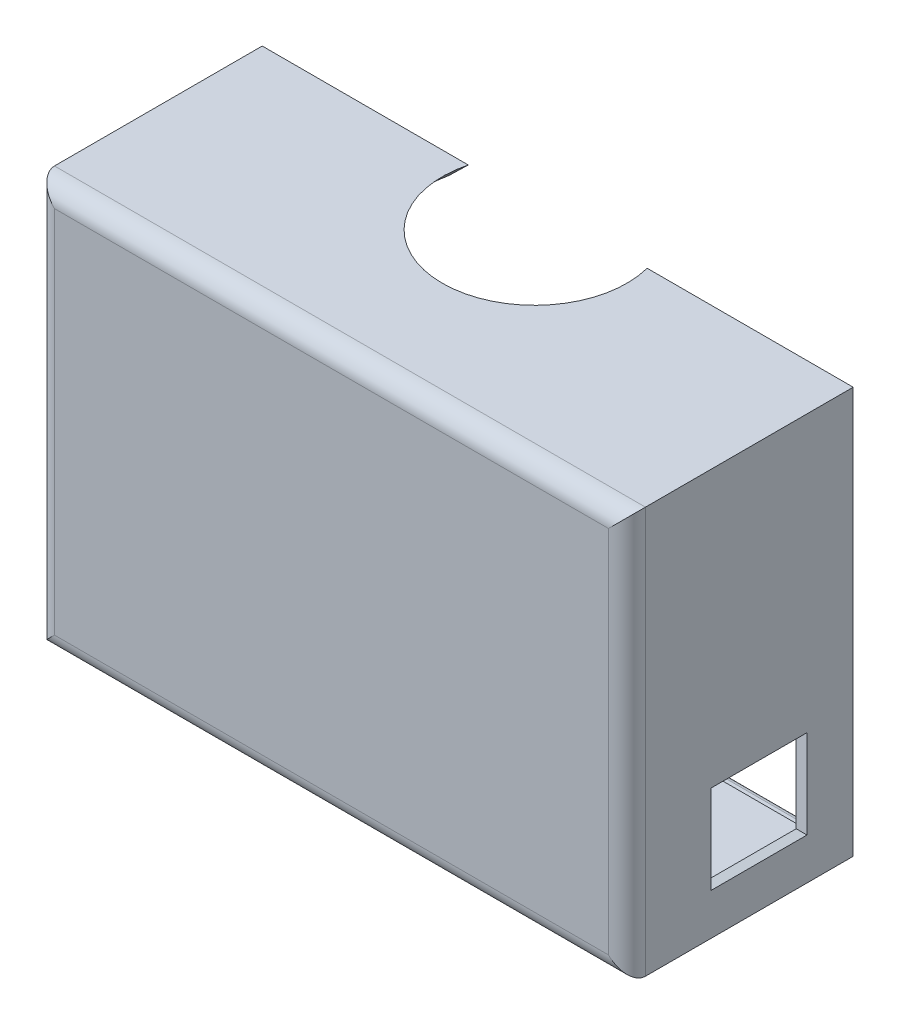
ISO-10303-21;
HEADER;
FILE_DESCRIPTION(('STEP AP214'),'2;1');
FILE_NAME('part.step','',(''),(''),'','','');
FILE_SCHEMA(('AUTOMOTIVE_DESIGN { 1 0 10303 214 1 1 1 1 }'));
ENDSEC;
DATA;
#1=APPLICATION_CONTEXT('core data for automotive mechanical design processes');
#2=APPLICATION_PROTOCOL_DEFINITION('international standard','automotive_design',2000,#1);
#3=PRODUCT_CONTEXT('',#1,'mechanical');
#4=PRODUCT('Part','Part','',(#3));
#5=PRODUCT_RELATED_PRODUCT_CATEGORY('part','',(#4));
#6=PRODUCT_DEFINITION_FORMATION('','',#4);
#7=PRODUCT_DEFINITION_CONTEXT('part definition',#1,'design');
#8=PRODUCT_DEFINITION('design','',#6,#7);
#9=PRODUCT_DEFINITION_SHAPE('','',#8);
#10=(LENGTH_UNIT() NAMED_UNIT(*) SI_UNIT(.MILLI.,.METRE.));
#11=(NAMED_UNIT(*) PLANE_ANGLE_UNIT() SI_UNIT($,.RADIAN.));
#12=(NAMED_UNIT(*) SI_UNIT($,.STERADIAN.) SOLID_ANGLE_UNIT());
#13=UNCERTAINTY_MEASURE_WITH_UNIT(LENGTH_MEASURE(1.E-05),#10,'distance_accuracy_value','');
#14=(GEOMETRIC_REPRESENTATION_CONTEXT(3) GLOBAL_UNCERTAINTY_ASSIGNED_CONTEXT((#13)) GLOBAL_UNIT_ASSIGNED_CONTEXT((#10,
#11,#12)) REPRESENTATION_CONTEXT('',''));
#15=CARTESIAN_POINT('',(0.,0.,0.));
#16=DIRECTION('',(0.,0.,1.));
#17=DIRECTION('',(1.,0.,0.));
#18=AXIS2_PLACEMENT_3D('',#15,#16,#17);
#19=CARTESIAN_POINT('',(-35.1511127596439,30.4555044510386,28.575));
#20=DIRECTION('',(1.,0.,0.));
#21=DIRECTION('',(0.,1.,0.));
#22=AXIS2_PLACEMENT_3D('',#19,#20,#21);
#23=PLANE('',#22);
#24=DIRECTION('',(0.,0.,-1.));
#25=VECTOR('',#24,1.);
#26=CARTESIAN_POINT('',(-35.1511127596439,-20.3444955489614,28.575));
#27=LINE('',#26,#25);
#28=CARTESIAN_POINT('',(-35.1511127596439,-20.3444955489614,28.575));
#29=VERTEX_POINT('',#28);
#30=CARTESIAN_POINT('',(-35.1511127596439,-20.3444955489614,2.54));
#31=VERTEX_POINT('',#30);
#32=EDGE_CURVE('E284',#29,#31,#27,.T.);
#33=ORIENTED_EDGE('',*,*,#32,.T.);
#34=DIRECTION('',(0.,-1.,0.));
#35=VECTOR('',#34,1.);
#36=CARTESIAN_POINT('',(-35.1511127596439,30.4555044510386,2.54));
#37=LINE('',#36,#35);
#38=CARTESIAN_POINT('',(-35.1511127596439,30.4555044510386,2.54));
#39=VERTEX_POINT('',#38);
#40=EDGE_CURVE('E242',#39,#31,#37,.T.);
#41=ORIENTED_EDGE('',*,*,#40,.F.);
#42=DIRECTION('',(0.,0.,-1.));
#43=VECTOR('',#42,1.);
#44=CARTESIAN_POINT('',(-35.1511127596439,30.4555044510386,28.575));
#45=LINE('',#44,#43);
#46=CARTESIAN_POINT('',(-35.1511127596439,30.4555044510386,28.575));
#47=VERTEX_POINT('',#46);
#48=EDGE_CURVE('E275',#47,#39,#45,.T.);
#49=ORIENTED_EDGE('',*,*,#48,.F.);
#50=DIRECTION('',(0.,-1.,0.));
#51=VECTOR('',#50,1.);
#52=CARTESIAN_POINT('',(-35.1511127596439,30.4555044510386,28.575));
#53=LINE('',#52,#51);
#54=EDGE_CURVE('E263',#47,#29,#53,.T.);
#55=ORIENTED_EDGE('',*,*,#54,.T.);
#56=EDGE_LOOP('',(#33,#41,#49,#55));
#57=FACE_BOUND('',#56,.T.);
#58=ADVANCED_FACE('F33',(#57),#23,.T.);
#59=CARTESIAN_POINT('',(-35.1511127596439,-20.3444955489614,28.575));
#60=DIRECTION('',(0.,1.,0.));
#61=DIRECTION('',(0.,0.,1.));
#62=AXIS2_PLACEMENT_3D('',#59,#60,#61);
#63=PLANE('',#62);
#64=DIRECTION('',(0.,0.,-1.));
#65=VECTOR('',#64,1.);
#66=CARTESIAN_POINT('',(41.0488872403561,-20.3444955489614,28.575));
#67=LINE('',#66,#65);
#68=CARTESIAN_POINT('',(41.0488872403561,-20.3444955489614,28.575));
#69=VERTEX_POINT('',#68);
#70=CARTESIAN_POINT('',(41.0488872403561,-20.3444955489614,2.54));
#71=VERTEX_POINT('',#70);
#72=EDGE_CURVE('E281',#69,#71,#67,.T.);
#73=ORIENTED_EDGE('',*,*,#72,.T.);
#74=DIRECTION('',(1.,0.,0.));
#75=VECTOR('',#74,1.);
#76=CARTESIAN_POINT('',(41.0488872403561,-20.3444955489614,2.54));
#77=LINE('',#76,#75);
#78=EDGE_CURVE('E238',#31,#71,#77,.T.);
#79=ORIENTED_EDGE('',*,*,#78,.F.);
#80=ORIENTED_EDGE('',*,*,#32,.F.);
#81=DIRECTION('',(1.,0.,0.));
#82=VECTOR('',#81,1.);
#83=CARTESIAN_POINT('',(-35.1511127596439,-20.3444955489614,28.575));
#84=LINE('',#83,#82);
#85=EDGE_CURVE('E266',#29,#69,#84,.T.);
#86=ORIENTED_EDGE('',*,*,#85,.T.);
#87=EDGE_LOOP('',(#73,#79,#80,#86));
#88=FACE_BOUND('',#87,.T.);
#89=ADVANCED_FACE('F392',(#88),#63,.T.);
#90=CARTESIAN_POINT('',(41.0488872403561,30.4555044510386,28.575));
#91=DIRECTION('',(-1.,0.,0.));
#92=DIRECTION('',(0.,0.,1.));
#93=AXIS2_PLACEMENT_3D('',#90,#91,#92);
#94=PLANE('',#93);
#95=DIRECTION('',(0.,-1.,0.));
#96=VECTOR('',#95,1.);
#97=CARTESIAN_POINT('',(41.0488872403561,-17.1694955489614,20.6101024484277));
#98=LINE('',#97,#96);
#99=CARTESIAN_POINT('',(41.0488872403561,-3.92539310053377,20.6101024484277));
#100=VERTEX_POINT('',#99);
#101=CARTESIAN_POINT('',(41.0488872403561,-18.2215979973891,20.6101024484277));
#102=VERTEX_POINT('',#101);
#103=EDGE_CURVE('E312',#100,#102,#98,.T.);
#104=ORIENTED_EDGE('',*,*,#103,.T.);
#105=DIRECTION('',(0.,0.,-1.));
#106=VECTOR('',#105,1.);
#107=CARTESIAN_POINT('',(41.0488872403561,-18.2215979973891,6.35));
#108=LINE('',#107,#106);
#109=CARTESIAN_POINT('',(41.0488872403561,-18.2215979973891,5.29789755157234));
#110=VERTEX_POINT('',#109);
#111=EDGE_CURVE('E314',#102,#110,#108,.T.);
#112=ORIENTED_EDGE('',*,*,#111,.T.);
#113=DIRECTION('',(0.,1.,0.));
#114=VECTOR('',#113,1.);
#115=CARTESIAN_POINT('',(41.0488872403561,-4.97749554896143,5.29789755157234));
#116=LINE('',#115,#114);
#117=CARTESIAN_POINT('',(41.0488872403561,-3.92539310053377,5.29789755157234));
#118=VERTEX_POINT('',#117);
#119=EDGE_CURVE('E308',#110,#118,#116,.T.);
#120=ORIENTED_EDGE('',*,*,#119,.T.);
#121=DIRECTION('',(0.,0.,1.));
#122=VECTOR('',#121,1.);
#123=CARTESIAN_POINT('',(41.0488872403561,-3.92539310053377,19.558));
#124=LINE('',#123,#122);
#125=EDGE_CURVE('E310',#118,#100,#124,.T.);
#126=ORIENTED_EDGE('',*,*,#125,.T.);
#127=EDGE_LOOP('',(#104,#112,#120,#126));
#128=FACE_BOUND('',#127,.T.);
#129=DIRECTION('',(0.,0.,-1.));
#130=VECTOR('',#129,1.);
#131=CARTESIAN_POINT('',(41.0488872403561,30.4555044510386,28.575));
#132=LINE('',#131,#130);
#133=CARTESIAN_POINT('',(41.0488872403561,30.4555044510386,28.575));
#134=VERTEX_POINT('',#133);
#135=CARTESIAN_POINT('',(41.0488872403561,30.4555044510386,2.54));
#136=VERTEX_POINT('',#135);
#137=EDGE_CURVE('E279',#134,#136,#132,.T.);
#138=ORIENTED_EDGE('',*,*,#137,.T.);
#139=DIRECTION('',(0.,1.,0.));
#140=VECTOR('',#139,1.);
#141=CARTESIAN_POINT('',(41.0488872403561,30.4555044510386,2.54));
#142=LINE('',#141,#140);
#143=EDGE_CURVE('E228',#71,#136,#142,.T.);
#144=ORIENTED_EDGE('',*,*,#143,.F.);
#145=ORIENTED_EDGE('',*,*,#72,.F.);
#146=DIRECTION('',(0.,1.,0.));
#147=VECTOR('',#146,1.);
#148=CARTESIAN_POINT('',(41.0488872403561,30.4555044510386,28.575));
#149=LINE('',#148,#147);
#150=EDGE_CURVE('E269',#69,#134,#149,.T.);
#151=ORIENTED_EDGE('',*,*,#150,.T.);
#152=EDGE_LOOP('',(#138,#144,#145,#151));
#153=FACE_BOUND('',#152,.T.);
#154=ADVANCED_FACE('F349',(#128,#153),#94,.T.);
#155=CARTESIAN_POINT('',(0.,0.,0.));
#156=DIRECTION('',(0.,0.,1.));
#157=DIRECTION('',(1.,0.,0.));
#158=AXIS2_PLACEMENT_3D('',#155,#156,#157);
#159=PLANE('',#158);
#160=DIRECTION('',(1.,0.,0.));
#161=VECTOR('',#160,1.);
#162=CARTESIAN_POINT('',(0.,32.4875044510386,0.));
#163=LINE('',#162,#161);
#164=CARTESIAN_POINT('',(43.0808872403561,32.4875044510386,0.));
#165=VERTEX_POINT('',#164);
#166=CARTESIAN_POINT('',(21.9988872403561,32.4875044510386,0.));
#167=VERTEX_POINT('',#166);
#168=EDGE_CURVE('E460',#165,#167,#163,.F.);
#169=ORIENTED_EDGE('',*,*,#168,.T.);
#170=DIRECTION('',(0.,1.,0.));
#171=VECTOR('',#170,1.);
#172=CARTESIAN_POINT('',(21.9988872403561,31.7255044510386,0.));
#173=LINE('',#172,#171);
#174=CARTESIAN_POINT('',(21.9988872403561,30.4555044510386,0.));
#175=VERTEX_POINT('',#174);
#176=EDGE_CURVE('E407',#175,#167,#173,.T.);
#177=ORIENTED_EDGE('',*,*,#176,.F.);
#178=DIRECTION('',(-1.,0.,0.));
#179=VECTOR('',#178,1.);
#180=CARTESIAN_POINT('',(-35.1511127596439,30.4555044510386,0.));
#181=LINE('',#180,#179);
#182=CARTESIAN_POINT('',(17.8544893751241,30.4555044510386,0.));
#183=VERTEX_POINT('',#182);
#184=EDGE_CURVE('E237',#175,#183,#181,.T.);
#185=ORIENTED_EDGE('',*,*,#184,.T.);
#186=CARTESIAN_POINT('',(17.8544893751241,30.4555044510386,0.));
#187=CARTESIAN_POINT('',(17.6375656491127,30.6676666900331,0.));
#188=CARTESIAN_POINT('',(17.4205431148589,30.8797279697235,0.));
#189=CARTESIAN_POINT('',(16.9862691020261,31.3036152837259,0.));
#190=CARTESIAN_POINT('',(16.7690176238058,31.5154413184053,0.));
#191=CARTESIAN_POINT('',(16.3342536315907,31.9388255625029,0.));
#192=CARTESIAN_POINT('',(16.1167411174934,32.1503837718159,0.));
#193=CARTESIAN_POINT('',(15.6814129614903,32.5731887455268,0.));
#194=CARTESIAN_POINT('',(15.4635973191101,32.7844355094364,0.));
#195=CARTESIAN_POINT('',(15.2456093645647,32.9955044510386,0.));
#196=B_SPLINE_CURVE_WITH_KNOTS('',3,(#186,#187,#188,#189,#190,#191,#192,#193,#194,#195),
.UNSPECIFIED.,.F.,.F.,(4,2,2,2,4),(0.,0.910284860639138,1.82056829776038,2.73085209228318,
3.64113731247536),.UNSPECIFIED.);
#197=CARTESIAN_POINT('',(15.2456093645646,32.9955044510386,0.));
#198=VERTEX_POINT('',#197);
#199=EDGE_CURVE('E317',#183,#198,#196,.T.);
#200=ORIENTED_EDGE('',*,*,#199,.T.);
#201=DIRECTION('',(-1.,0.,0.));
#202=VECTOR('',#201,1.);
#203=CARTESIAN_POINT('',(-37.6911127596439,32.9955044510386,0.));
#204=LINE('',#203,#202);
#205=CARTESIAN_POINT('',(43.5888872403561,32.9955044510386,0.));
#206=VERTEX_POINT('',#205);
#207=EDGE_CURVE('E297',#206,#198,#204,.T.);
#208=ORIENTED_EDGE('',*,*,#207,.F.);
#209=DIRECTION('',(0.,1.,0.));
#210=VECTOR('',#209,1.);
#211=CARTESIAN_POINT('',(43.5888872403561,32.9955044510386,0.));
#212=LINE('',#211,#210);
#213=CARTESIAN_POINT('',(43.5888872403561,-22.8844955489614,0.));
#214=VERTEX_POINT('',#213);
#215=EDGE_CURVE('E293',#214,#206,#212,.T.);
#216=ORIENTED_EDGE('',*,*,#215,.F.);
#217=DIRECTION('',(1.,0.,0.));
#218=VECTOR('',#217,1.);
#219=CARTESIAN_POINT('',(-37.6911127596439,-22.8844955489614,0.));
#220=LINE('',#219,#218);
#221=CARTESIAN_POINT('',(-37.6911127596439,-22.8844955489614,0.));
#222=VERTEX_POINT('',#221);
#223=EDGE_CURVE('E290',#222,#214,#220,.T.);
#224=ORIENTED_EDGE('',*,*,#223,.F.);
#225=DIRECTION('',(0.,-1.,0.));
#226=VECTOR('',#225,1.);
#227=CARTESIAN_POINT('',(-37.6911127596439,32.9955044510386,0.));
#228=LINE('',#227,#226);
#229=CARTESIAN_POINT('',(-37.6911127596439,32.9955044510386,0.));
#230=VERTEX_POINT('',#229);
#231=EDGE_CURVE('E287',#230,#222,#228,.T.);
#232=ORIENTED_EDGE('',*,*,#231,.F.);
#233=CARTESIAN_POINT('',(-9.34783488385245,32.9955044510386,0.));
#234=VERTEX_POINT('',#233);
#235=EDGE_CURVE('E296',#234,#230,#204,.T.);
#236=ORIENTED_EDGE('',*,*,#235,.F.);
#237=CARTESIAN_POINT('',(-9.34783488385245,32.9955044510386,0.));
#238=CARTESIAN_POINT('',(-9.56582283839795,32.7844355094364,0.));
#239=CARTESIAN_POINT('',(-9.78363848077808,32.5731887455268,0.));
#240=CARTESIAN_POINT('',(-10.2189666367812,32.1503837718159,0.));
#241=CARTESIAN_POINT('',(-10.4364791508785,31.9388255625029,0.));
#242=CARTESIAN_POINT('',(-10.8712431430936,31.5154413184053,0.));
#243=CARTESIAN_POINT('',(-11.0884946213139,31.3036152837259,0.));
#244=CARTESIAN_POINT('',(-11.5227686341467,30.8797279697235,0.));
#245=CARTESIAN_POINT('',(-11.7397911684005,30.6676666900331,0.));
#246=CARTESIAN_POINT('',(-11.9567148944119,30.4555044510386,0.));
#247=B_SPLINE_CURVE_WITH_KNOTS('',3,(#237,#238,#239,#240,#241,#242,#243,#244,#245,#246),
.UNSPECIFIED.,.F.,.F.,(4,2,2,2,4),(0.,0.910285220192179,1.82056901471498,2.73085245183623,
3.64113731247536),.UNSPECIFIED.);
#248=CARTESIAN_POINT('',(-11.9567148944119,30.4555044510386,0.));
#249=VERTEX_POINT('',#248);
#250=EDGE_CURVE('E334',#234,#249,#247,.T.);
#251=ORIENTED_EDGE('',*,*,#250,.T.);
#252=CARTESIAN_POINT('',(-16.1011127596439,30.4555044510386,0.));
#253=VERTEX_POINT('',#252);
#254=EDGE_CURVE('E262',#249,#253,#181,.T.);
#255=ORIENTED_EDGE('',*,*,#254,.T.);
#256=DIRECTION('',(0.,-1.,0.));
#257=VECTOR('',#256,1.);
#258=CARTESIAN_POINT('',(-16.1011127596439,31.7255044510386,0.));
#259=LINE('',#258,#257);
#260=CARTESIAN_POINT('',(-16.1011127596439,32.4875044510386,0.));
#261=VERTEX_POINT('',#260);
#262=EDGE_CURVE('E404',#261,#253,#259,.T.);
#263=ORIENTED_EDGE('',*,*,#262,.F.);
#264=DIRECTION('',(1.,0.,0.));
#265=VECTOR('',#264,1.);
#266=CARTESIAN_POINT('',(0.,32.4875044510386,0.));
#267=LINE('',#266,#265);
#268=CARTESIAN_POINT('',(-37.1831127596439,32.4875044510386,0.));
#269=VERTEX_POINT('',#268);
#270=EDGE_CURVE('E564',#261,#269,#267,.F.);
#271=ORIENTED_EDGE('',*,*,#270,.T.);
#272=DIRECTION('',(0.,1.,0.));
#273=VECTOR('',#272,1.);
#274=CARTESIAN_POINT('',(-37.1831127596439,0.,0.));
#275=LINE('',#274,#273);
#276=CARTESIAN_POINT('',(-37.1831127596439,-22.3764955489614,0.));
#277=VERTEX_POINT('',#276);
#278=EDGE_CURVE('E583',#269,#277,#275,.F.);
#279=ORIENTED_EDGE('',*,*,#278,.T.);
#280=DIRECTION('',(-1.,0.,0.));
#281=VECTOR('',#280,1.);
#282=CARTESIAN_POINT('',(0.,-22.3764955489614,0.));
#283=LINE('',#282,#281);
#284=CARTESIAN_POINT('',(43.0808872403561,-22.3764955489614,0.));
#285=VERTEX_POINT('',#284);
#286=EDGE_CURVE('E587',#277,#285,#283,.F.);
#287=ORIENTED_EDGE('',*,*,#286,.T.);
#288=DIRECTION('',(0.,-1.,0.));
#289=VECTOR('',#288,1.);
#290=CARTESIAN_POINT('',(43.0808872403561,0.,0.));
#291=LINE('',#290,#289);
#292=EDGE_CURVE('E589',#285,#165,#291,.F.);
#293=ORIENTED_EDGE('',*,*,#292,.T.);
#294=EDGE_LOOP('',(#169,#177,#185,#200,#208,#216,#224,#232,#236,#251,#255,#263,#271,#279,#287,#293));
#295=FACE_BOUND('',#294,.T.);
#296=ADVANCED_FACE('F343',(#295),#159,.F.);
#297=CARTESIAN_POINT('',(-37.6911127596439,32.9955044510386,28.575));
#298=DIRECTION('',(1.,0.,0.));
#299=DIRECTION('',(0.,0.,-1.));
#300=AXIS2_PLACEMENT_3D('',#297,#298,#299);
#301=PLANE('',#300);
#302=DIRECTION('',(0.,0.,-1.));
#303=VECTOR('',#302,1.);
#304=CARTESIAN_POINT('',(-37.6911127596439,-22.8844955489614,28.575));
#305=LINE('',#304,#303);
#306=CARTESIAN_POINT('',(-37.6911127596439,-22.8844955489614,28.575));
#307=VERTEX_POINT('',#306);
#308=EDGE_CURVE('E306',#307,#222,#305,.T.);
#309=ORIENTED_EDGE('',*,*,#308,.F.);
#310=DIRECTION('',(0.,-1.,0.));
#311=VECTOR('',#310,1.);
#312=CARTESIAN_POINT('',(-37.6911127596439,32.9955044510386,28.575));
#313=LINE('',#312,#311);
#314=CARTESIAN_POINT('',(-37.6911127596439,32.9955044510386,28.575));
#315=VERTEX_POINT('',#314);
#316=EDGE_CURVE('E497',#307,#315,#313,.F.);
#317=ORIENTED_EDGE('',*,*,#316,.T.);
#318=DIRECTION('',(0.,0.,-1.));
#319=VECTOR('',#318,1.);
#320=CARTESIAN_POINT('',(-37.6911127596439,32.9955044510386,28.575));
#321=LINE('',#320,#319);
#322=EDGE_CURVE('E300',#315,#230,#321,.T.);
#323=ORIENTED_EDGE('',*,*,#322,.T.);
#324=ORIENTED_EDGE('',*,*,#231,.T.);
#325=EDGE_LOOP('',(#309,#317,#323,#324));
#326=FACE_BOUND('',#325,.T.);
#327=ADVANCED_FACE('F348',(#326),#301,.F.);
#328=CARTESIAN_POINT('',(-37.6911127596439,-22.8844955489614,28.575));
#329=DIRECTION('',(0.,1.,0.));
#330=DIRECTION('',(0.,0.,1.));
#331=AXIS2_PLACEMENT_3D('',#328,#329,#330);
#332=PLANE('',#331);
#333=DIRECTION('',(0.,0.,-1.));
#334=VECTOR('',#333,1.);
#335=CARTESIAN_POINT('',(43.5888872403561,-22.8844955489614,28.575));
#336=LINE('',#335,#334);
#337=CARTESIAN_POINT('',(43.5888872403561,-22.8844955489614,28.575));
#338=VERTEX_POINT('',#337);
#339=EDGE_CURVE('E304',#338,#214,#336,.T.);
#340=ORIENTED_EDGE('',*,*,#339,.F.);
#341=DIRECTION('',(1.,0.,0.));
#342=VECTOR('',#341,1.);
#343=CARTESIAN_POINT('',(-37.6911127596439,-22.8844955489614,28.575));
#344=LINE('',#343,#342);
#345=EDGE_CURVE('E500',#338,#307,#344,.F.);
#346=ORIENTED_EDGE('',*,*,#345,.T.);
#347=ORIENTED_EDGE('',*,*,#308,.T.);
#348=ORIENTED_EDGE('',*,*,#223,.T.);
#349=EDGE_LOOP('',(#340,#346,#347,#348));
#350=FACE_BOUND('',#349,.T.);
#351=ADVANCED_FACE('F359',(#350),#332,.F.);
#352=CARTESIAN_POINT('',(43.5888872403561,32.9955044510386,28.575));
#353=DIRECTION('',(-1.,0.,0.));
#354=DIRECTION('',(0.,0.,1.));
#355=AXIS2_PLACEMENT_3D('',#352,#353,#354);
#356=PLANE('',#355);
#357=DIRECTION('',(0.,0.,-1.));
#358=VECTOR('',#357,1.);
#359=CARTESIAN_POINT('',(43.5888872403561,-17.1694955489614,19.558));
#360=LINE('',#359,#358);
#361=CARTESIAN_POINT('',(43.5888872403561,-17.1694955489614,19.558));
#362=VERTEX_POINT('',#361);
#363=CARTESIAN_POINT('',(43.5888872403561,-17.1694955489614,6.35));
#364=VERTEX_POINT('',#363);
#365=EDGE_CURVE('E253',#362,#364,#360,.T.);
#366=ORIENTED_EDGE('',*,*,#365,.F.);
#367=DIRECTION('',(0.,-1.,0.));
#368=VECTOR('',#367,1.);
#369=CARTESIAN_POINT('',(43.5888872403561,-4.97749554896143,19.558));
#370=LINE('',#369,#368);
#371=CARTESIAN_POINT('',(43.5888872403561,-4.97749554896143,19.558));
#372=VERTEX_POINT('',#371);
#373=EDGE_CURVE('E249',#372,#362,#370,.T.);
#374=ORIENTED_EDGE('',*,*,#373,.F.);
#375=DIRECTION('',(0.,0.,1.));
#376=VECTOR('',#375,1.);
#377=CARTESIAN_POINT('',(43.5888872403561,-4.97749554896143,19.558));
#378=LINE('',#377,#376);
#379=CARTESIAN_POINT('',(43.5888872403561,-4.97749554896143,6.35));
#380=VERTEX_POINT('',#379);
#381=EDGE_CURVE('E259',#380,#372,#378,.T.);
#382=ORIENTED_EDGE('',*,*,#381,.F.);
#383=DIRECTION('',(0.,1.,0.));
#384=VECTOR('',#383,1.);
#385=CARTESIAN_POINT('',(43.5888872403561,-4.97749554896143,6.35));
#386=LINE('',#385,#384);
#387=EDGE_CURVE('E256',#364,#380,#386,.T.);
#388=ORIENTED_EDGE('',*,*,#387,.F.);
#389=EDGE_LOOP('',(#366,#374,#382,#388));
#390=FACE_BOUND('',#389,.T.);
#391=DIRECTION('',(0.,0.,-1.));
#392=VECTOR('',#391,1.);
#393=CARTESIAN_POINT('',(43.5888872403561,32.9955044510386,28.575));
#394=LINE('',#393,#392);
#395=CARTESIAN_POINT('',(43.5888872403561,32.9955044510386,28.575));
#396=VERTEX_POINT('',#395);
#397=EDGE_CURVE('E302',#396,#206,#394,.T.);
#398=ORIENTED_EDGE('',*,*,#397,.F.);
#399=DIRECTION('',(0.,1.,0.));
#400=VECTOR('',#399,1.);
#401=CARTESIAN_POINT('',(43.5888872403561,-22.8844955489614,28.575));
#402=LINE('',#401,#400);
#403=EDGE_CURVE('E42',#396,#338,#402,.F.);
#404=ORIENTED_EDGE('',*,*,#403,.T.);
#405=ORIENTED_EDGE('',*,*,#339,.T.);
#406=ORIENTED_EDGE('',*,*,#215,.T.);
#407=EDGE_LOOP('',(#398,#404,#405,#406));
#408=FACE_BOUND('',#407,.T.);
#409=ADVANCED_FACE('F356',(#390,#408),#356,.F.);
#410=CARTESIAN_POINT('',(-37.6911127596439,32.9955044510386,28.575));
#411=DIRECTION('',(0.,-1.,0.));
#412=DIRECTION('',(0.,0.,-1.));
#413=AXIS2_PLACEMENT_3D('',#410,#411,#412);
#414=PLANE('',#413);
#415=ORIENTED_EDGE('',*,*,#322,.F.);
#416=DIRECTION('',(-1.,0.,0.));
#417=VECTOR('',#416,1.);
#418=CARTESIAN_POINT('',(43.5888872403561,32.9955044510386,28.575));
#419=LINE('',#418,#417);
#420=EDGE_CURVE('E11',#315,#396,#419,.F.);
#421=ORIENTED_EDGE('',*,*,#420,.T.);
#422=ORIENTED_EDGE('',*,*,#397,.T.);
#423=ORIENTED_EDGE('',*,*,#207,.T.);
#424=CARTESIAN_POINT('',(2.9488872403561,32.9955044510386,3.175));
#425=DIRECTION('',(0.,1.,0.));
#426=DIRECTION('',(0.,0.,1.));
#427=AXIS2_PLACEMENT_3D('',#424,#425,#426);
#428=CIRCLE('',#427,12.7);
#429=EDGE_CURVE('E246',#234,#198,#428,.T.);
#430=ORIENTED_EDGE('',*,*,#429,.F.);
#431=ORIENTED_EDGE('',*,*,#235,.T.);
#432=EDGE_LOOP('',(#415,#421,#422,#423,#430,#431));
#433=FACE_BOUND('',#432,.T.);
#434=ADVANCED_FACE('F352',(#433),#414,.F.);
#435=CARTESIAN_POINT('',(-35.1511127596439,30.4555044510386,28.575));
#436=DIRECTION('',(0.,-1.,0.));
#437=DIRECTION('',(0.,0.,-1.));
#438=AXIS2_PLACEMENT_3D('',#435,#436,#437);
#439=PLANE('',#438);
#440=ORIENTED_EDGE('',*,*,#254,.F.);
#441=CARTESIAN_POINT('',(2.9488872403561,30.4555044510386,3.175));
#442=DIRECTION('',(0.,-1.,0.));
#443=DIRECTION('',(0.,0.,-1.));
#444=AXIS2_PLACEMENT_3D('',#441,#442,#443);
#445=CIRCLE('',#444,15.24);
#446=EDGE_CURVE('E581',#249,#183,#445,.F.);
#447=ORIENTED_EDGE('',*,*,#446,.T.);
#448=ORIENTED_EDGE('',*,*,#184,.F.);
#449=DIRECTION('',(0.,0.,-1.));
#450=VECTOR('',#449,1.);
#451=CARTESIAN_POINT('',(21.9988872403561,30.4555044510386,2.54));
#452=LINE('',#451,#450);
#453=CARTESIAN_POINT('',(21.9988872403561,30.4555044510386,2.54));
#454=VERTEX_POINT('',#453);
#455=EDGE_CURVE('E215',#454,#175,#452,.T.);
#456=ORIENTED_EDGE('',*,*,#455,.F.);
#457=DIRECTION('',(-1.,0.,0.));
#458=VECTOR('',#457,1.);
#459=CARTESIAN_POINT('',(41.0488872403561,30.4555044510386,2.54));
#460=LINE('',#459,#458);
#461=EDGE_CURVE('E223',#136,#454,#460,.T.);
#462=ORIENTED_EDGE('',*,*,#461,.F.);
#463=ORIENTED_EDGE('',*,*,#137,.F.);
#464=DIRECTION('',(-1.,0.,0.));
#465=VECTOR('',#464,1.);
#466=CARTESIAN_POINT('',(-35.1511127596439,30.4555044510386,28.575));
#467=LINE('',#466,#465);
#468=EDGE_CURVE('E272',#134,#47,#467,.T.);
#469=ORIENTED_EDGE('',*,*,#468,.T.);
#470=ORIENTED_EDGE('',*,*,#48,.T.);
#471=DIRECTION('',(-1.,0.,0.));
#472=VECTOR('',#471,1.);
#473=CARTESIAN_POINT('',(-35.1511127596439,30.4555044510386,2.54));
#474=LINE('',#473,#472);
#475=CARTESIAN_POINT('',(-16.1011127596439,30.4555044510386,2.54));
#476=VERTEX_POINT('',#475);
#477=EDGE_CURVE('E426',#476,#39,#474,.T.);
#478=ORIENTED_EDGE('',*,*,#477,.F.);
#479=DIRECTION('',(0.,0.,-1.));
#480=VECTOR('',#479,1.);
#481=CARTESIAN_POINT('',(-16.1011127596439,30.4555044510386,2.54));
#482=LINE('',#481,#480);
#483=EDGE_CURVE('E321',#476,#253,#482,.T.);
#484=ORIENTED_EDGE('',*,*,#483,.T.);
#485=EDGE_LOOP('',(#440,#447,#448,#456,#462,#463,#469,#470,#478,#484));
#486=FACE_BOUND('',#485,.T.);
#487=ADVANCED_FACE('F235',(#486),#439,.T.);
#488=CARTESIAN_POINT('',(0.,0.,28.575));
#489=DIRECTION('',(0.,0.,1.));
#490=DIRECTION('',(1.,0.,0.));
#491=AXIS2_PLACEMENT_3D('',#488,#489,#490);
#492=PLANE('',#491);
#493=ORIENTED_EDGE('',*,*,#85,.F.);
#494=ORIENTED_EDGE('',*,*,#54,.F.);
#495=ORIENTED_EDGE('',*,*,#468,.F.);
#496=ORIENTED_EDGE('',*,*,#150,.F.);
#497=EDGE_LOOP('',(#493,#494,#495,#496));
#498=FACE_BOUND('',#497,.T.);
#499=ADVANCED_FACE('F387',(#498),#492,.F.);
#500=CARTESIAN_POINT('',(0.,0.,31.115));
#501=DIRECTION('',(0.,0.,1.));
#502=DIRECTION('',(1.,0.,0.));
#503=AXIS2_PLACEMENT_3D('',#500,#501,#502);
#504=PLANE('',#503);
#505=DIRECTION('',(-1.,0.,0.));
#506=VECTOR('',#505,1.);
#507=CARTESIAN_POINT('',(-37.6911127596439,30.4555044510386,31.115));
#508=LINE('',#507,#506);
#509=CARTESIAN_POINT('',(41.0488872403561,30.4555044510386,31.115));
#510=VERTEX_POINT('',#509);
#511=CARTESIAN_POINT('',(-35.1511127596439,30.4555044510386,31.115));
#512=VERTEX_POINT('',#511);
#513=EDGE_CURVE('E483',#510,#512,#508,.T.);
#514=ORIENTED_EDGE('',*,*,#513,.T.);
#515=DIRECTION('',(0.,-1.,0.));
#516=VECTOR('',#515,1.);
#517=CARTESIAN_POINT('',(-35.1511127596439,-22.8844955489614,31.115));
#518=LINE('',#517,#516);
#519=CARTESIAN_POINT('',(-35.1511127596439,-20.3444955489614,31.115));
#520=VERTEX_POINT('',#519);
#521=EDGE_CURVE('E494',#512,#520,#518,.T.);
#522=ORIENTED_EDGE('',*,*,#521,.T.);
#523=DIRECTION('',(1.,0.,0.));
#524=VECTOR('',#523,1.);
#525=CARTESIAN_POINT('',(43.5888872403561,-20.3444955489614,31.115));
#526=LINE('',#525,#524);
#527=CARTESIAN_POINT('',(41.0488872403561,-20.3444955489614,31.115));
#528=VERTEX_POINT('',#527);
#529=EDGE_CURVE('E492',#520,#528,#526,.T.);
#530=ORIENTED_EDGE('',*,*,#529,.T.);
#531=DIRECTION('',(0.,1.,0.));
#532=VECTOR('',#531,1.);
#533=CARTESIAN_POINT('',(41.0488872403561,32.9955044510386,31.115));
#534=LINE('',#533,#532);
#535=EDGE_CURVE('E490',#528,#510,#534,.T.);
#536=ORIENTED_EDGE('',*,*,#535,.T.);
#537=EDGE_LOOP('',(#514,#522,#530,#536));
#538=FACE_BOUND('',#537,.T.);
#539=ADVANCED_FACE('F381',(#538),#504,.T.);
#540=CARTESIAN_POINT('',(41.0488872403561,-3.92539310053377,28.575));
#541=DIRECTION('',(-0.382683432365086,-0.923879532511288,0.));
#542=DIRECTION('',(0.,0.,-1.));
#543=AXIS2_PLACEMENT_3D('',#540,#541,#542);
#544=PLANE('',#543);
#545=DIRECTION('',(-0.862856209461019,0.35740674433659,-0.357406744336591));
#546=VECTOR('',#545,1.);
#547=CARTESIAN_POINT('',(48.227327497672,-6.89880041179899,8.27130486283757));
#548=LINE('',#547,#546);
#549=EDGE_CURVE('E323',#380,#118,#548,.T.);
#550=ORIENTED_EDGE('',*,*,#549,.F.);
#551=ORIENTED_EDGE('',*,*,#381,.T.);
#552=DIRECTION('',(-0.862856209461019,0.35740674433659,0.357406744336591));
#553=VECTOR('',#552,1.);
#554=CARTESIAN_POINT('',(30.4461406307354,0.466408343576422,25.0019038925379));
#555=LINE('',#554,#553);
#556=EDGE_CURVE('E250',#100,#372,#555,.F.);
#557=ORIENTED_EDGE('',*,*,#556,.F.);
#558=ORIENTED_EDGE('',*,*,#125,.F.);
#559=EDGE_LOOP('',(#550,#551,#557,#558));
#560=FACE_BOUND('',#559,.T.);
#561=ADVANCED_FACE('F378',(#560),#544,.T.);
#562=CARTESIAN_POINT('',(41.0488872403561,30.4555044510386,20.6101024484277));
#563=DIRECTION('',(-0.382683432365086,0.,-0.923879532511288));
#564=DIRECTION('',(0.,1.,0.));
#565=AXIS2_PLACEMENT_3D('',#562,#563,#564);
#566=PLANE('',#565);
#567=ORIENTED_EDGE('',*,*,#556,.T.);
#568=ORIENTED_EDGE('',*,*,#373,.T.);
#569=DIRECTION('',(-0.862856209461019,-0.357406744336589,0.357406744336591));
#570=VECTOR('',#569,1.);
#571=CARTESIAN_POINT('',(38.5925874772614,-19.2390306725167,21.6275351235553));
#572=LINE('',#571,#570);
#573=EDGE_CURVE('E320',#102,#362,#572,.F.);
#574=ORIENTED_EDGE('',*,*,#573,.F.);
#575=ORIENTED_EDGE('',*,*,#103,.F.);
#576=EDGE_LOOP('',(#567,#568,#574,#575));
#577=FACE_BOUND('',#576,.T.);
#578=ADVANCED_FACE('F375',(#577),#566,.T.);
#579=CARTESIAN_POINT('',(41.0488872403561,30.4555044510386,5.29789755157234));
#580=DIRECTION('',(-0.382683432365086,0.,0.923879532511288));
#581=DIRECTION('',(0.,-1.,0.));
#582=AXIS2_PLACEMENT_3D('',#579,#580,#581);
#583=PLANE('',#582);
#584=ORIENTED_EDGE('',*,*,#549,.T.);
#585=ORIENTED_EDGE('',*,*,#119,.F.);
#586=DIRECTION('',(0.862856209461019,0.357406744336589,0.357406744336591));
#587=VECTOR('',#586,1.);
#588=CARTESIAN_POINT('',(48.227327497672,-15.2481906861239,8.27130486283757));
#589=LINE('',#588,#587);
#590=EDGE_CURVE('E318',#364,#110,#589,.F.);
#591=ORIENTED_EDGE('',*,*,#590,.F.);
#592=ORIENTED_EDGE('',*,*,#387,.T.);
#593=EDGE_LOOP('',(#584,#585,#591,#592));
#594=FACE_BOUND('',#593,.T.);
#595=ADVANCED_FACE('F371',(#594),#583,.T.);
#596=CARTESIAN_POINT('',(41.0488872403561,-18.2215979973891,28.575));
#597=DIRECTION('',(-0.382683432365085,0.923879532511289,0.));
#598=DIRECTION('',(0.,0.,1.));
#599=AXIS2_PLACEMENT_3D('',#596,#597,#598);
#600=PLANE('',#599);
#601=ORIENTED_EDGE('',*,*,#573,.T.);
#602=ORIENTED_EDGE('',*,*,#365,.T.);
#603=ORIENTED_EDGE('',*,*,#590,.T.);
#604=ORIENTED_EDGE('',*,*,#111,.F.);
#605=EDGE_LOOP('',(#601,#602,#603,#604));
#606=FACE_BOUND('',#605,.T.);
#607=ADVANCED_FACE('F367',(#606),#600,.T.);
#608=CARTESIAN_POINT('',(-16.1011127596439,31.7255044510386,2.54));
#609=DIRECTION('',(1.,0.,0.));
#610=DIRECTION('',(0.,0.,-1.));
#611=AXIS2_PLACEMENT_3D('',#608,#609,#610);
#612=PLANE('',#611);
#613=ORIENTED_EDGE('',*,*,#262,.T.);
#614=ORIENTED_EDGE('',*,*,#483,.F.);
#615=DIRECTION('',(0.,-1.,0.));
#616=VECTOR('',#615,1.);
#617=CARTESIAN_POINT('',(-16.1011127596439,31.7255044510386,2.54));
#618=LINE('',#617,#616);
#619=CARTESIAN_POINT('',(-16.1011127596439,31.7255044510386,2.54));
#620=VERTEX_POINT('',#619);
#621=EDGE_CURVE('E423',#620,#476,#618,.T.);
#622=ORIENTED_EDGE('',*,*,#621,.F.);
#623=DIRECTION('',(0.,0.,-1.));
#624=VECTOR('',#623,1.);
#625=CARTESIAN_POINT('',(-16.1011127596439,31.7255044510386,2.54));
#626=LINE('',#625,#624);
#627=CARTESIAN_POINT('',(-16.1011127596439,31.7255044510386,0.762));
#628=VERTEX_POINT('',#627);
#629=EDGE_CURVE('E433',#620,#628,#626,.T.);
#630=ORIENTED_EDGE('',*,*,#629,.T.);
#631=CARTESIAN_POINT('',(-16.1011127596439,32.4875044510386,0.762));
#632=DIRECTION('',(1.,0.,0.));
#633=DIRECTION('',(0.,0.,-1.));
#634=AXIS2_PLACEMENT_3D('',#631,#632,#633);
#635=CIRCLE('',#634,0.762);
#636=EDGE_CURVE('E480',#628,#261,#635,.T.);
#637=ORIENTED_EDGE('',*,*,#636,.T.);
#638=EDGE_LOOP('',(#613,#614,#622,#630,#637));
#639=FACE_BOUND('',#638,.T.);
#640=ADVANCED_FACE('F370',(#639),#612,.F.);
#641=CARTESIAN_POINT('',(-36.4211127596439,31.7255044510386,2.54));
#642=DIRECTION('',(0.,1.,0.));
#643=DIRECTION('',(0.,0.,1.));
#644=AXIS2_PLACEMENT_3D('',#641,#642,#643);
#645=PLANE('',#644);
#646=DIRECTION('',(0.,0.,-1.));
#647=VECTOR('',#646,1.);
#648=CARTESIAN_POINT('',(-36.4211127596439,31.7255044510386,2.54));
#649=LINE('',#648,#647);
#650=CARTESIAN_POINT('',(-36.4211127596439,31.7255044510386,2.54));
#651=VERTEX_POINT('',#650);
#652=CARTESIAN_POINT('',(-36.4211127596439,31.7255044510386,0.762));
#653=VERTEX_POINT('',#652);
#654=EDGE_CURVE('E436',#651,#653,#649,.T.);
#655=ORIENTED_EDGE('',*,*,#654,.T.);
#656=DIRECTION('',(1.,0.,0.));
#657=VECTOR('',#656,1.);
#658=CARTESIAN_POINT('',(-36.4211127596439,31.7255044510386,0.762));
#659=LINE('',#658,#657);
#660=EDGE_CURVE('E472',#653,#628,#659,.T.);
#661=ORIENTED_EDGE('',*,*,#660,.T.);
#662=ORIENTED_EDGE('',*,*,#629,.F.);
#663=DIRECTION('',(1.,0.,0.));
#664=VECTOR('',#663,1.);
#665=CARTESIAN_POINT('',(-36.4211127596439,31.7255044510386,2.54));
#666=LINE('',#665,#664);
#667=EDGE_CURVE('E420',#651,#620,#666,.T.);
#668=ORIENTED_EDGE('',*,*,#667,.F.);
#669=EDGE_LOOP('',(#655,#661,#662,#668));
#670=FACE_BOUND('',#669,.T.);
#671=ADVANCED_FACE('F569',(#670),#645,.F.);
#672=CARTESIAN_POINT('',(-36.4211127596439,31.7255044510386,2.54));
#673=DIRECTION('',(-1.,0.,0.));
#674=DIRECTION('',(0.,-1.,0.));
#675=AXIS2_PLACEMENT_3D('',#672,#673,#674);
#676=PLANE('',#675);
#677=DIRECTION('',(0.,0.,-1.));
#678=VECTOR('',#677,1.);
#679=CARTESIAN_POINT('',(-36.4211127596439,-21.6144955489614,2.54));
#680=LINE('',#679,#678);
#681=CARTESIAN_POINT('',(-36.4211127596439,-21.6144955489614,2.54));
#682=VERTEX_POINT('',#681);
#683=CARTESIAN_POINT('',(-36.4211127596439,-21.6144955489614,0.762));
#684=VERTEX_POINT('',#683);
#685=EDGE_CURVE('E439',#682,#684,#680,.T.);
#686=ORIENTED_EDGE('',*,*,#685,.T.);
#687=DIRECTION('',(0.,1.,0.));
#688=VECTOR('',#687,1.);
#689=CARTESIAN_POINT('',(-36.4211127596439,31.7255044510386,0.762));
#690=LINE('',#689,#688);
#691=EDGE_CURVE('E470',#684,#653,#690,.T.);
#692=ORIENTED_EDGE('',*,*,#691,.T.);
#693=ORIENTED_EDGE('',*,*,#654,.F.);
#694=DIRECTION('',(0.,1.,0.));
#695=VECTOR('',#694,1.);
#696=CARTESIAN_POINT('',(-36.4211127596439,31.7255044510386,2.54));
#697=LINE('',#696,#695);
#698=EDGE_CURVE('E417',#682,#651,#697,.T.);
#699=ORIENTED_EDGE('',*,*,#698,.F.);
#700=EDGE_LOOP('',(#686,#692,#693,#699));
#701=FACE_BOUND('',#700,.T.);
#702=ADVANCED_FACE('F572',(#701),#676,.F.);
#703=CARTESIAN_POINT('',(42.3188872403561,-21.6144955489614,2.54));
#704=DIRECTION('',(0.,-1.,0.));
#705=DIRECTION('',(0.,0.,-1.));
#706=AXIS2_PLACEMENT_3D('',#703,#704,#705);
#707=PLANE('',#706);
#708=DIRECTION('',(0.,0.,-1.));
#709=VECTOR('',#708,1.);
#710=CARTESIAN_POINT('',(42.3188872403561,-21.6144955489614,2.54));
#711=LINE('',#710,#709);
#712=CARTESIAN_POINT('',(42.3188872403561,-21.6144955489614,2.54));
#713=VERTEX_POINT('',#712);
#714=CARTESIAN_POINT('',(42.3188872403561,-21.6144955489614,0.762));
#715=VERTEX_POINT('',#714);
#716=EDGE_CURVE('E442',#713,#715,#711,.T.);
#717=ORIENTED_EDGE('',*,*,#716,.T.);
#718=DIRECTION('',(-1.,0.,0.));
#719=VECTOR('',#718,1.);
#720=CARTESIAN_POINT('',(42.3188872403561,-21.6144955489614,0.762));
#721=LINE('',#720,#719);
#722=EDGE_CURVE('E578',#715,#684,#721,.T.);
#723=ORIENTED_EDGE('',*,*,#722,.T.);
#724=ORIENTED_EDGE('',*,*,#685,.F.);
#725=DIRECTION('',(-1.,0.,0.));
#726=VECTOR('',#725,1.);
#727=CARTESIAN_POINT('',(42.3188872403561,-21.6144955489614,2.54));
#728=LINE('',#727,#726);
#729=EDGE_CURVE('E414',#713,#682,#728,.T.);
#730=ORIENTED_EDGE('',*,*,#729,.F.);
#731=EDGE_LOOP('',(#717,#723,#724,#730));
#732=FACE_BOUND('',#731,.T.);
#733=ADVANCED_FACE('F579',(#732),#707,.F.);
#734=CARTESIAN_POINT('',(42.3188872403561,31.7255044510386,2.54));
#735=DIRECTION('',(1.,0.,0.));
#736=DIRECTION('',(0.,1.,0.));
#737=AXIS2_PLACEMENT_3D('',#734,#735,#736);
#738=PLANE('',#737);
#739=DIRECTION('',(0.,0.,-1.));
#740=VECTOR('',#739,1.);
#741=CARTESIAN_POINT('',(42.3188872403561,31.7255044510386,2.54));
#742=LINE('',#741,#740);
#743=CARTESIAN_POINT('',(42.3188872403561,31.7255044510386,2.54));
#744=VERTEX_POINT('',#743);
#745=CARTESIAN_POINT('',(42.3188872403561,31.7255044510386,0.762));
#746=VERTEX_POINT('',#745);
#747=EDGE_CURVE('E240',#744,#746,#742,.T.);
#748=ORIENTED_EDGE('',*,*,#747,.T.);
#749=DIRECTION('',(0.,-1.,0.));
#750=VECTOR('',#749,1.);
#751=CARTESIAN_POINT('',(42.3188872403561,31.7255044510386,0.762));
#752=LINE('',#751,#750);
#753=EDGE_CURVE('E450',#746,#715,#752,.T.);
#754=ORIENTED_EDGE('',*,*,#753,.T.);
#755=ORIENTED_EDGE('',*,*,#716,.F.);
#756=DIRECTION('',(0.,-1.,0.));
#757=VECTOR('',#756,1.);
#758=CARTESIAN_POINT('',(42.3188872403561,31.7255044510386,2.54));
#759=LINE('',#758,#757);
#760=EDGE_CURVE('E411',#744,#713,#759,.T.);
#761=ORIENTED_EDGE('',*,*,#760,.F.);
#762=EDGE_LOOP('',(#748,#754,#755,#761));
#763=FACE_BOUND('',#762,.T.);
#764=ADVANCED_FACE('F448',(#763),#738,.F.);
#765=CARTESIAN_POINT('',(42.3188872403561,31.7255044510386,2.54));
#766=DIRECTION('',(0.,1.,0.));
#767=DIRECTION('',(0.,0.,1.));
#768=AXIS2_PLACEMENT_3D('',#765,#766,#767);
#769=PLANE('',#768);
#770=DIRECTION('',(0.,0.,-1.));
#771=VECTOR('',#770,1.);
#772=CARTESIAN_POINT('',(21.9988872403561,31.7255044510386,2.54));
#773=LINE('',#772,#771);
#774=CARTESIAN_POINT('',(21.9988872403561,31.7255044510386,2.54));
#775=VERTEX_POINT('',#774);
#776=CARTESIAN_POINT('',(21.9988872403561,31.7255044510386,0.762));
#777=VERTEX_POINT('',#776);
#778=EDGE_CURVE('E218',#775,#777,#773,.T.);
#779=ORIENTED_EDGE('',*,*,#778,.T.);
#780=DIRECTION('',(1.,0.,0.));
#781=VECTOR('',#780,1.);
#782=CARTESIAN_POINT('',(42.3188872403561,31.7255044510386,0.762));
#783=LINE('',#782,#781);
#784=EDGE_CURVE('E458',#777,#746,#783,.T.);
#785=ORIENTED_EDGE('',*,*,#784,.T.);
#786=ORIENTED_EDGE('',*,*,#747,.F.);
#787=DIRECTION('',(1.,0.,0.));
#788=VECTOR('',#787,1.);
#789=CARTESIAN_POINT('',(42.3188872403561,31.7255044510386,2.54));
#790=LINE('',#789,#788);
#791=EDGE_CURVE('E222',#775,#744,#790,.T.);
#792=ORIENTED_EDGE('',*,*,#791,.F.);
#793=EDGE_LOOP('',(#779,#785,#786,#792));
#794=FACE_BOUND('',#793,.T.);
#795=ADVANCED_FACE('F590',(#794),#769,.F.);
#796=CARTESIAN_POINT('',(21.9988872403561,31.7255044510386,2.54));
#797=DIRECTION('',(-1.,0.,0.));
#798=DIRECTION('',(0.,0.,1.));
#799=AXIS2_PLACEMENT_3D('',#796,#797,#798);
#800=PLANE('',#799);
#801=ORIENTED_EDGE('',*,*,#176,.T.);
#802=CARTESIAN_POINT('',(21.9988872403561,32.4875044510386,0.762));
#803=DIRECTION('',(-1.,0.,0.));
#804=DIRECTION('',(0.,0.,1.));
#805=AXIS2_PLACEMENT_3D('',#802,#803,#804);
#806=CIRCLE('',#805,0.762);
#807=EDGE_CURVE('E478',#167,#777,#806,.T.);
#808=ORIENTED_EDGE('',*,*,#807,.T.);
#809=ORIENTED_EDGE('',*,*,#778,.F.);
#810=DIRECTION('',(0.,1.,0.));
#811=VECTOR('',#810,1.);
#812=CARTESIAN_POINT('',(21.9988872403561,31.7255044510386,2.54));
#813=LINE('',#812,#811);
#814=EDGE_CURVE('E211',#454,#775,#813,.T.);
#815=ORIENTED_EDGE('',*,*,#814,.F.);
#816=ORIENTED_EDGE('',*,*,#455,.T.);
#817=EDGE_LOOP('',(#801,#808,#809,#815,#816));
#818=FACE_BOUND('',#817,.T.);
#819=ADVANCED_FACE('F213',(#818),#800,.F.);
#820=CARTESIAN_POINT('',(0.,0.,2.54));
#821=DIRECTION('',(0.,0.,-1.));
#822=DIRECTION('',(-1.,0.,0.));
#823=AXIS2_PLACEMENT_3D('',#820,#821,#822);
#824=PLANE('',#823);
#825=ORIENTED_EDGE('',*,*,#143,.T.);
#826=ORIENTED_EDGE('',*,*,#461,.T.);
#827=ORIENTED_EDGE('',*,*,#814,.T.);
#828=ORIENTED_EDGE('',*,*,#791,.T.);
#829=ORIENTED_EDGE('',*,*,#760,.T.);
#830=ORIENTED_EDGE('',*,*,#729,.T.);
#831=ORIENTED_EDGE('',*,*,#698,.T.);
#832=ORIENTED_EDGE('',*,*,#667,.T.);
#833=ORIENTED_EDGE('',*,*,#621,.T.);
#834=ORIENTED_EDGE('',*,*,#477,.T.);
#835=ORIENTED_EDGE('',*,*,#40,.T.);
#836=ORIENTED_EDGE('',*,*,#78,.T.);
#837=EDGE_LOOP('',(#825,#826,#827,#828,#829,#830,#831,#832,#833,#834,#835,#836));
#838=FACE_BOUND('',#837,.T.);
#839=ADVANCED_FACE('F226',(#838),#824,.T.);
#840=CARTESIAN_POINT('',(2.9488872403561,32.9955044510386,3.175));
#841=DIRECTION('',(0.,-1.,0.));
#842=DIRECTION('',(0.,0.,-1.));
#843=AXIS2_PLACEMENT_3D('',#840,#841,#842);
#844=CONICAL_SURFACE('',#843,12.7,0.78539816339745);
#845=ORIENTED_EDGE('',*,*,#199,.F.);
#846=ORIENTED_EDGE('',*,*,#446,.F.);
#847=ORIENTED_EDGE('',*,*,#250,.F.);
#848=ORIENTED_EDGE('',*,*,#429,.T.);
#849=EDGE_LOOP('',(#845,#846,#847,#848));
#850=FACE_BOUND('',#849,.T.);
#851=ADVANCED_FACE('F339',(#850),#844,.F.);
#852=CARTESIAN_POINT('',(42.3188872403561,32.4875044510386,0.762));
#853=DIRECTION('',(1.,0.,0.));
#854=DIRECTION('',(0.,0.,-1.));
#855=AXIS2_PLACEMENT_3D('',#852,#853,#854);
#856=CYLINDRICAL_SURFACE('',#855,0.762);
#857=ORIENTED_EDGE('',*,*,#807,.F.);
#858=ORIENTED_EDGE('',*,*,#168,.F.);
#859=CARTESIAN_POINT('',(43.0808872403561,32.4875044510386,0.762));
#860=DIRECTION('',(0.707106781186547,-0.707106781186548,0.));
#861=DIRECTION('',(-0.707106781186548,-0.707106781186547,0.));
#862=AXIS2_PLACEMENT_3D('',#859,#860,#861);
#863=ELLIPSE('',#862,1.0776307345283,0.762);
#864=EDGE_CURVE('E429',#746,#165,#863,.T.);
#865=ORIENTED_EDGE('',*,*,#864,.F.);
#866=ORIENTED_EDGE('',*,*,#784,.F.);
#867=EDGE_LOOP('',(#857,#858,#865,#866));
#868=FACE_BOUND('',#867,.T.);
#869=ADVANCED_FACE('F457',(#868),#856,.T.);
#870=CARTESIAN_POINT('',(-36.4211127596439,32.4875044510386,0.762));
#871=DIRECTION('',(1.,0.,0.));
#872=DIRECTION('',(0.,0.,-1.));
#873=AXIS2_PLACEMENT_3D('',#870,#871,#872);
#874=CYLINDRICAL_SURFACE('',#873,0.762);
#875=ORIENTED_EDGE('',*,*,#636,.F.);
#876=ORIENTED_EDGE('',*,*,#660,.F.);
#877=CARTESIAN_POINT('',(-37.1831127596439,32.4875044510386,0.762));
#878=DIRECTION('',(0.707106781186548,0.707106781186547,0.));
#879=DIRECTION('',(-0.707106781186547,0.707106781186548,0.));
#880=AXIS2_PLACEMENT_3D('',#877,#878,#879);
#881=ELLIPSE('',#880,1.0776307345283,0.762);
#882=EDGE_CURVE('E463',#269,#653,#881,.F.);
#883=ORIENTED_EDGE('',*,*,#882,.F.);
#884=ORIENTED_EDGE('',*,*,#270,.F.);
#885=EDGE_LOOP('',(#875,#876,#883,#884));
#886=FACE_BOUND('',#885,.T.);
#887=ADVANCED_FACE('F554',(#886),#874,.T.);
#888=CARTESIAN_POINT('',(43.0808872403561,31.7255044510386,0.762));
#889=DIRECTION('',(0.,-1.,0.));
#890=DIRECTION('',(1.,0.,0.));
#891=AXIS2_PLACEMENT_3D('',#888,#889,#890);
#892=CYLINDRICAL_SURFACE('',#891,0.762);
#893=ORIENTED_EDGE('',*,*,#864,.T.);
#894=ORIENTED_EDGE('',*,*,#292,.F.);
#895=CARTESIAN_POINT('',(43.0808872403561,-22.3764955489614,0.762));
#896=DIRECTION('',(-0.707106781186548,-0.707106781186547,0.));
#897=DIRECTION('',(-0.707106781186547,0.707106781186548,0.));
#898=AXIS2_PLACEMENT_3D('',#895,#896,#897);
#899=ELLIPSE('',#898,1.0776307345283,0.762);
#900=EDGE_CURVE('E468',#715,#285,#899,.T.);
#901=ORIENTED_EDGE('',*,*,#900,.F.);
#902=ORIENTED_EDGE('',*,*,#753,.F.);
#903=EDGE_LOOP('',(#893,#894,#901,#902));
#904=FACE_BOUND('',#903,.T.);
#905=ADVANCED_FACE('F466',(#904),#892,.T.);
#906=CARTESIAN_POINT('',(-37.1831127596439,31.7255044510386,0.762));
#907=DIRECTION('',(0.,1.,0.));
#908=DIRECTION('',(-1.,0.,0.));
#909=AXIS2_PLACEMENT_3D('',#906,#907,#908);
#910=CYLINDRICAL_SURFACE('',#909,0.762);
#911=ORIENTED_EDGE('',*,*,#882,.T.);
#912=ORIENTED_EDGE('',*,*,#691,.F.);
#913=CARTESIAN_POINT('',(-37.1831127596439,-22.3764955489614,0.762));
#914=DIRECTION('',(-0.707106781186547,0.707106781186548,0.));
#915=DIRECTION('',(-0.707106781186548,-0.707106781186547,0.));
#916=AXIS2_PLACEMENT_3D('',#913,#914,#915);
#917=ELLIPSE('',#916,1.0776307345283,0.762);
#918=EDGE_CURVE('E484',#277,#684,#917,.F.);
#919=ORIENTED_EDGE('',*,*,#918,.F.);
#920=ORIENTED_EDGE('',*,*,#278,.F.);
#921=EDGE_LOOP('',(#911,#912,#919,#920));
#922=FACE_BOUND('',#921,.T.);
#923=ADVANCED_FACE('F545',(#922),#910,.T.);
#924=CARTESIAN_POINT('',(42.3188872403561,-22.3764955489614,0.762));
#925=DIRECTION('',(-1.,0.,0.));
#926=DIRECTION('',(0.,0.,1.));
#927=AXIS2_PLACEMENT_3D('',#924,#925,#926);
#928=CYLINDRICAL_SURFACE('',#927,0.762);
#929=ORIENTED_EDGE('',*,*,#900,.T.);
#930=ORIENTED_EDGE('',*,*,#286,.F.);
#931=ORIENTED_EDGE('',*,*,#918,.T.);
#932=ORIENTED_EDGE('',*,*,#722,.F.);
#933=EDGE_LOOP('',(#929,#930,#931,#932));
#934=FACE_BOUND('',#933,.T.);
#935=ADVANCED_FACE('F541',(#934),#928,.T.);
#936=CARTESIAN_POINT('',(41.0488872403561,0.,28.575));
#937=DIRECTION('',(0.,-1.,0.));
#938=DIRECTION('',(0.,0.,-1.));
#939=AXIS2_PLACEMENT_3D('',#936,#937,#938);
#940=CYLINDRICAL_SURFACE('',#939,2.54);
#941=CARTESIAN_POINT('',(41.0488872403561,-20.3444955489614,28.575));
#942=DIRECTION('',(-0.707106781186547,-0.707106781186547,0.));
#943=DIRECTION('',(0.707106781186547,-0.707106781186547,0.));
#944=AXIS2_PLACEMENT_3D('',#941,#942,#943);
#945=ELLIPSE('',#944,3.59210244842766,2.54);
#946=EDGE_CURVE('E506',#338,#528,#945,.T.);
#947=ORIENTED_EDGE('',*,*,#946,.F.);
#948=ORIENTED_EDGE('',*,*,#403,.F.);
#949=CARTESIAN_POINT('',(41.0488872403561,30.4555044510386,28.575));
#950=DIRECTION('',(0.707106781186547,-0.707106781186547,0.));
#951=DIRECTION('',(0.707106781186547,0.707106781186547,0.));
#952=AXIS2_PLACEMENT_3D('',#949,#950,#951);
#953=ELLIPSE('',#952,3.59210244842766,2.54);
#954=EDGE_CURVE('E37',#510,#396,#953,.F.);
#955=ORIENTED_EDGE('',*,*,#954,.F.);
#956=ORIENTED_EDGE('',*,*,#535,.F.);
#957=EDGE_LOOP('',(#947,#948,#955,#956));
#958=FACE_BOUND('',#957,.T.);
#959=ADVANCED_FACE('F35',(#958),#940,.T.);
#960=CARTESIAN_POINT('',(0.,30.4555044510386,28.575));
#961=DIRECTION('',(1.,0.,0.));
#962=DIRECTION('',(0.,0.,-1.));
#963=AXIS2_PLACEMENT_3D('',#960,#961,#962);
#964=CYLINDRICAL_SURFACE('',#963,2.54);
#965=ORIENTED_EDGE('',*,*,#954,.T.);
#966=ORIENTED_EDGE('',*,*,#420,.F.);
#967=CARTESIAN_POINT('',(-35.1511127596439,30.4555044510386,28.575));
#968=DIRECTION('',(0.707106781186547,0.707106781186547,0.));
#969=DIRECTION('',(0.707106781186547,-0.707106781186547,0.));
#970=AXIS2_PLACEMENT_3D('',#967,#968,#969);
#971=ELLIPSE('',#970,3.59210244842766,2.54);
#972=EDGE_CURVE('E505',#512,#315,#971,.F.);
#973=ORIENTED_EDGE('',*,*,#972,.F.);
#974=ORIENTED_EDGE('',*,*,#513,.F.);
#975=EDGE_LOOP('',(#965,#966,#973,#974));
#976=FACE_BOUND('',#975,.T.);
#977=ADVANCED_FACE('F516',(#976),#964,.T.);
#978=CARTESIAN_POINT('',(0.,-20.3444955489614,28.575));
#979=DIRECTION('',(-1.,0.,0.));
#980=DIRECTION('',(0.,0.,1.));
#981=AXIS2_PLACEMENT_3D('',#978,#979,#980);
#982=CYLINDRICAL_SURFACE('',#981,2.54);
#983=ORIENTED_EDGE('',*,*,#946,.T.);
#984=ORIENTED_EDGE('',*,*,#529,.F.);
#985=CARTESIAN_POINT('',(-35.1511127596439,-20.3444955489614,28.575));
#986=DIRECTION('',(-0.707106781186547,0.707106781186547,0.));
#987=DIRECTION('',(-0.707106781186547,-0.707106781186547,0.));
#988=AXIS2_PLACEMENT_3D('',#985,#986,#987);
#989=ELLIPSE('',#988,3.59210244842766,2.54);
#990=EDGE_CURVE('E503',#307,#520,#989,.T.);
#991=ORIENTED_EDGE('',*,*,#990,.F.);
#992=ORIENTED_EDGE('',*,*,#345,.F.);
#993=EDGE_LOOP('',(#983,#984,#991,#992));
#994=FACE_BOUND('',#993,.T.);
#995=ADVANCED_FACE('F521',(#994),#982,.T.);
#996=CARTESIAN_POINT('',(-35.1511127596439,0.,28.575));
#997=DIRECTION('',(0.,1.,0.));
#998=DIRECTION('',(0.,0.,1.));
#999=AXIS2_PLACEMENT_3D('',#996,#997,#998);
#1000=CYLINDRICAL_SURFACE('',#999,2.54);
#1001=ORIENTED_EDGE('',*,*,#972,.T.);
#1002=ORIENTED_EDGE('',*,*,#316,.F.);
#1003=ORIENTED_EDGE('',*,*,#990,.T.);
#1004=ORIENTED_EDGE('',*,*,#521,.F.);
#1005=EDGE_LOOP('',(#1001,#1002,#1003,#1004));
#1006=FACE_BOUND('',#1005,.T.);
#1007=ADVANCED_FACE('F527',(#1006),#1000,.T.);
#1008=CLOSED_SHELL('',(#58,#89,#154,#296,#327,#351,#409,#434,#487,#499,#539,#561,#578,#595,#607,
#640,#671,#702,#733,#764,#795,#819,#839,#851,#869,#887,#905,#923,#935,#959,#977,#995,#1007));
#1009=MANIFOLD_SOLID_BREP('B2',#1008);
#1010=ADVANCED_BREP_SHAPE_REPRESENTATION('',(#18,#1009),#14);
#1011=SHAPE_DEFINITION_REPRESENTATION(#9,#1010);
ENDSEC;
END-ISO-10303-21;
